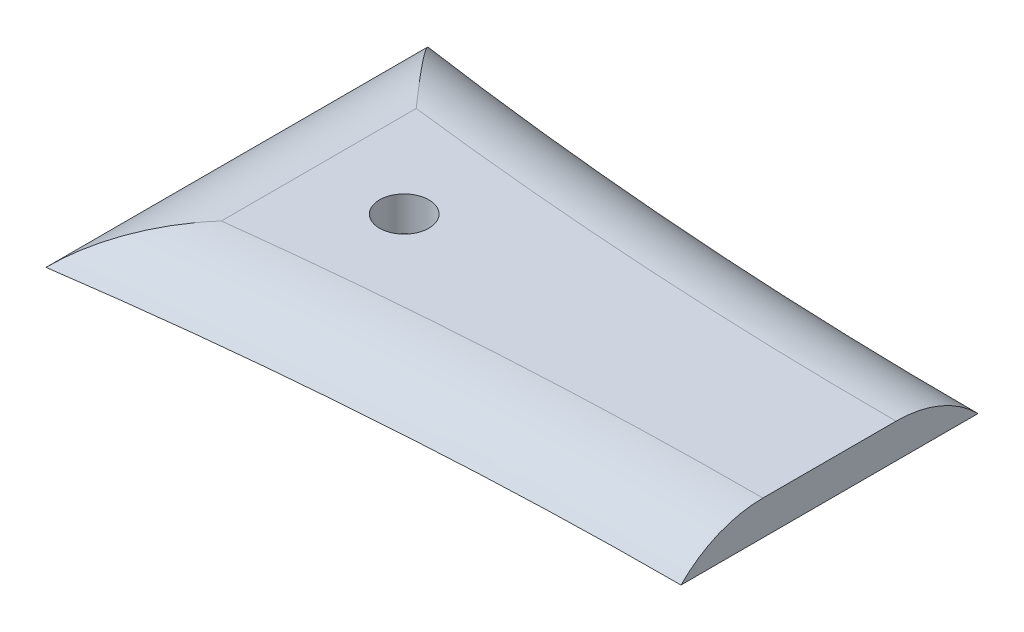
ISO-10303-21;
HEADER;
FILE_DESCRIPTION(('STEP AP214'),'2;1');
FILE_NAME('part.step','',(''),(''),'','','');
FILE_SCHEMA(('AUTOMOTIVE_DESIGN { 1 0 10303 214 1 1 1 1 }'));
ENDSEC;
DATA;
#1=APPLICATION_CONTEXT('core data for automotive mechanical design processes');
#2=APPLICATION_PROTOCOL_DEFINITION('international standard','automotive_design',2000,#1);
#3=PRODUCT_CONTEXT('',#1,'mechanical');
#4=PRODUCT('Part','Part','',(#3));
#5=PRODUCT_RELATED_PRODUCT_CATEGORY('part','',(#4));
#6=PRODUCT_DEFINITION_FORMATION('','',#4);
#7=PRODUCT_DEFINITION_CONTEXT('part definition',#1,'design');
#8=PRODUCT_DEFINITION('design','',#6,#7);
#9=PRODUCT_DEFINITION_SHAPE('','',#8);
#10=(LENGTH_UNIT() NAMED_UNIT(*) SI_UNIT(.MILLI.,.METRE.));
#11=(NAMED_UNIT(*) PLANE_ANGLE_UNIT() SI_UNIT($,.RADIAN.));
#12=(NAMED_UNIT(*) SI_UNIT($,.STERADIAN.) SOLID_ANGLE_UNIT());
#13=UNCERTAINTY_MEASURE_WITH_UNIT(LENGTH_MEASURE(1.E-05),#10,'distance_accuracy_value','');
#14=(GEOMETRIC_REPRESENTATION_CONTEXT(3) GLOBAL_UNCERTAINTY_ASSIGNED_CONTEXT((#13)) GLOBAL_UNIT_ASSIGNED_CONTEXT((#10,
#11,#12)) REPRESENTATION_CONTEXT('',''));
#15=CARTESIAN_POINT('',(0.,0.,0.));
#16=DIRECTION('',(0.,0.,1.));
#17=DIRECTION('',(1.,0.,0.));
#18=AXIS2_PLACEMENT_3D('',#15,#16,#17);
#19=CARTESIAN_POINT('',(69.6952615184339,109.,-379.68937505856));
#20=DIRECTION('',(0.,1.,0.));
#21=DIRECTION('',(0.,0.,1.));
#22=AXIS2_PLACEMENT_3D('',#19,#20,#21);
#23=PLANE('',#22);
#24=CARTESIAN_POINT('',(32.6163634932053,109.,-3.74289004787089));
#25=DIRECTION('',(0.,1.,0.));
#26=DIRECTION('',(0.,0.,1.));
#27=AXIS2_PLACEMENT_3D('',#24,#25,#26);
#28=CIRCLE('',#27,2.15);
#29=CARTESIAN_POINT('',(32.6163634932053,109.,-1.59289004787089));
#30=VERTEX_POINT('',#29);
#31=EDGE_CURVE('E89',#30,#30,#28,.T.);
#32=ORIENTED_EDGE('',*,*,#31,.F.);
#33=EDGE_LOOP('',(#32));
#34=FACE_BOUND('',#33,.T.);
#35=CARTESIAN_POINT('',(69.6952615184333,109.,372.203594962857));
#36=DIRECTION('',(0.,1.,0.));
#37=DIRECTION('',(0.,0.,1.));
#38=AXIS2_PLACEMENT_3D('',#35,#36,#37);
#39=CIRCLE('',#38,370.140811549953);
#40=CARTESIAN_POINT('',(25.1708678379279,109.,4.75047041192654));
#41=VERTEX_POINT('',#40);
#42=CARTESIAN_POINT('',(69.6952615184345,109.,2.06278341290339));
#43=VERTEX_POINT('',#42);
#44=EDGE_CURVE('E51',#41,#43,#39,.F.);
#45=ORIENTED_EDGE('',*,*,#44,.T.);
#46=DIRECTION('',(0.,0.,-1.));
#47=VECTOR('',#46,1.);
#48=CARTESIAN_POINT('',(69.6952615184345,109.,-379.68937505856));
#49=LINE('',#48,#47);
#50=CARTESIAN_POINT('',(69.6952615184339,109.,-9.54856350864486));
#51=VERTEX_POINT('',#50);
#52=EDGE_CURVE('E85',#43,#51,#49,.T.);
#53=ORIENTED_EDGE('',*,*,#52,.T.);
#54=CARTESIAN_POINT('',(69.6952615184339,109.,-379.68937505856));
#55=DIRECTION('',(0.,1.,0.));
#56=DIRECTION('',(0.,0.,1.));
#57=AXIS2_PLACEMENT_3D('',#54,#55,#56);
#58=CIRCLE('',#57,370.140811549916);
#59=CARTESIAN_POINT('',(25.1708678379279,109.,-12.2362505076684));
#60=VERTEX_POINT('',#59);
#61=EDGE_CURVE('E102',#51,#60,#58,.F.);
#62=ORIENTED_EDGE('',*,*,#61,.T.);
#63=DIRECTION('',(0.,0.,-1.));
#64=VECTOR('',#63,1.);
#65=CARTESIAN_POINT('',(25.1708678379279,109.,12.8998307572465));
#66=LINE('',#65,#64);
#67=EDGE_CURVE('E65',#60,#41,#66,.F.);
#68=ORIENTED_EDGE('',*,*,#67,.T.);
#69=EDGE_LOOP('',(#45,#53,#62,#68));
#70=FACE_BOUND('',#69,.T.);
#71=ADVANCED_FACE('F42',(#34,#70),#23,.T.);
#72=CARTESIAN_POINT('',(69.6952615184339,106.,-379.68937505856));
#73=DIRECTION('',(0.,1.,0.));
#74=DIRECTION('',(0.,0.,1.));
#75=AXIS2_PLACEMENT_3D('',#72,#73,#74);
#76=PLANE('',#75);
#77=CARTESIAN_POINT('',(32.6163634932053,106.,-3.74289004787089));
#78=DIRECTION('',(0.,1.,0.));
#79=DIRECTION('',(0.,0.,1.));
#80=AXIS2_PLACEMENT_3D('',#77,#78,#79);
#81=CIRCLE('',#80,2.15);
#82=CARTESIAN_POINT('',(32.6163634932053,106.,-1.59289004787089));
#83=VERTEX_POINT('',#82);
#84=EDGE_CURVE('E119',#83,#83,#81,.T.);
#85=ORIENTED_EDGE('',*,*,#84,.T.);
#86=EDGE_LOOP('',(#85));
#87=FACE_BOUND('',#86,.T.);
#88=DIRECTION('',(0.,0.,1.));
#89=VECTOR('',#88,1.);
#90=CARTESIAN_POINT('',(69.6952615184345,106.,0.));
#91=LINE('',#90,#89);
#92=CARTESIAN_POINT('',(69.6952615184345,106.,-16.6899919371877));
#93=VERTEX_POINT('',#92);
#94=CARTESIAN_POINT('',(69.6952615184345,106.,9.20421184144626));
#95=VERTEX_POINT('',#94);
#96=EDGE_CURVE('E58',#93,#95,#91,.T.);
#97=ORIENTED_EDGE('',*,*,#96,.T.);
#98=CARTESIAN_POINT('',(69.6952615184333,106.,372.203594962857));
#99=DIRECTION('',(0.,-1.,0.));
#100=DIRECTION('',(0.,0.,-1.));
#101=AXIS2_PLACEMENT_3D('',#98,#99,#100);
#102=CIRCLE('',#101,362.99938312141);
#103=CARTESIAN_POINT('',(18.0294394093851,106.,12.8998307572465));
#104=VERTEX_POINT('',#103);
#105=EDGE_CURVE('E95',#104,#95,#102,.T.);
#106=ORIENTED_EDGE('',*,*,#105,.F.);
#107=DIRECTION('',(0.,0.,1.));
#108=VECTOR('',#107,1.);
#109=CARTESIAN_POINT('',(18.0294394093851,106.,-20.3856108529885));
#110=LINE('',#109,#108);
#111=CARTESIAN_POINT('',(18.0294394093851,106.,-20.3856108529885));
#112=VERTEX_POINT('',#111);
#113=EDGE_CURVE('E103',#112,#104,#110,.T.);
#114=ORIENTED_EDGE('',*,*,#113,.F.);
#115=CARTESIAN_POINT('',(69.6952615184339,106.,-379.68937505856));
#116=DIRECTION('',(0.,-1.,0.));
#117=DIRECTION('',(0.,0.,1.));
#118=AXIS2_PLACEMENT_3D('',#115,#116,#117);
#119=CIRCLE('',#118,362.999383121373);
#120=EDGE_CURVE('E97',#93,#112,#119,.T.);
#121=ORIENTED_EDGE('',*,*,#120,.F.);
#122=EDGE_LOOP('',(#97,#106,#114,#121));
#123=FACE_BOUND('',#122,.T.);
#124=ADVANCED_FACE('F93',(#87,#123),#76,.F.);
#125=CARTESIAN_POINT('',(69.6952615184333,99.,372.203594962857));
#126=DIRECTION('',(0.,1.,0.));
#127=DIRECTION('',(0.,0.,1.));
#128=AXIS2_PLACEMENT_3D('',#125,#126,#127);
#129=TOROIDAL_SURFACE('',#128,370.140811549953,10.);
#130=ORIENTED_EDGE('',*,*,#105,.T.);
#131=CARTESIAN_POINT('',(69.6952615184333,99.,2.06278341290339));
#132=DIRECTION('',(1.,0.,0.));
#133=DIRECTION('',(0.,0.,-1.));
#134=AXIS2_PLACEMENT_3D('',#131,#132,#133);
#135=CIRCLE('',#134,10.);
#136=EDGE_CURVE('E82',#95,#43,#135,.F.);
#137=ORIENTED_EDGE('',*,*,#136,.T.);
#138=ORIENTED_EDGE('',*,*,#44,.F.);
#139=CARTESIAN_POINT('',(18.0294394093851,106.,12.8998307572465));
#140=CARTESIAN_POINT('',(18.1449813108946,106.117865969299,12.7664859797561));
#141=CARTESIAN_POINT('',(18.2622845363039,106.231712752767,12.631183162665));
#142=CARTESIAN_POINT('',(18.5000364090133,106.451593944441,12.3571080785624));
#143=CARTESIAN_POINT('',(18.6204843309905,106.557630132969,12.2183366119028));
#144=CARTESIAN_POINT('',(18.9857130839517,106.864148379039,11.7977955447066));
#145=CARTESIAN_POINT('',(19.2347098856554,107.053374246604,11.5114172311703));
#146=CARTESIAN_POINT('',(19.7410479827984,107.403069740267,10.9297811905293));
#147=CARTESIAN_POINT('',(19.9983755573208,107.563584066711,10.6345381167586));
#148=CARTESIAN_POINT('',(20.5200455747988,107.857738827676,10.0367552250998));
#149=CARTESIAN_POINT('',(20.7843909994028,107.991367625707,9.73421231089665));
#150=CARTESIAN_POINT('',(21.3828037631034,108.261902553993,9.05020399669834));
#151=CARTESIAN_POINT('',(21.7183392039255,108.391856916062,8.66726874106068));
#152=CARTESIAN_POINT('',(22.3954522670775,108.613739916917,7.89574285970273));
#153=CARTESIAN_POINT('',(22.7370308722088,108.70566231016,7.50715131595462));
#154=CARTESIAN_POINT('',(23.4239743836281,108.852494382297,6.72692131599745));
#155=CARTESIAN_POINT('',(23.7693363067705,108.907431350717,6.33528532243078));
#156=CARTESIAN_POINT('',(24.4622492564055,108.980938783045,5.55079797841888));
#157=CARTESIAN_POINT('',(24.8097990360909,108.999528357485,5.15794737547093));
#158=CARTESIAN_POINT('',(25.1619927522922,108.999997044012,4.76048591187061));
#159=CARTESIAN_POINT('',(25.1664302793188,108.99999999774,4.75547812842836));
#160=CARTESIAN_POINT('',(25.1708678379279,109.,4.75047041192648));
#161=B_SPLINE_CURVE_WITH_KNOTS('',3,(#139,#140,#141,#142,#143,#144,#145,#146,#147,#148,#149,
#150,#151,#152,#153,#154,#155,#156,#157,#158,#159,#160),.UNSPECIFIED.,.F.,.F.,(4,2,2,2,2,2,2,2,
2,2,4),(0.,0.636432251610286,1.27271898506955,2.54348036548556,3.81224577198662,
5.08155914480961,6.65636793901592,8.23143524295143,9.80533911321836,11.3784152422929,
11.3984882546566),.UNSPECIFIED.);
#162=EDGE_CURVE('E101',#41,#104,#161,.F.);
#163=ORIENTED_EDGE('',*,*,#162,.T.);
#164=EDGE_LOOP('',(#130,#137,#138,#163));
#165=FACE_BOUND('',#164,.T.);
#166=ADVANCED_FACE('F100',(#165),#129,.T.);
#167=CARTESIAN_POINT('',(69.6952615184339,99.,-379.68937505856));
#168=DIRECTION('',(0.,1.,0.));
#169=DIRECTION('',(0.,0.,1.));
#170=AXIS2_PLACEMENT_3D('',#167,#168,#169);
#171=TOROIDAL_SURFACE('',#170,370.140811549916,10.);
#172=ORIENTED_EDGE('',*,*,#61,.F.);
#173=CARTESIAN_POINT('',(69.6952615184339,99.,-9.54856350864486));
#174=DIRECTION('',(1.,0.,0.));
#175=DIRECTION('',(0.,0.,-1.));
#176=AXIS2_PLACEMENT_3D('',#173,#174,#175);
#177=CIRCLE('',#176,10.);
#178=EDGE_CURVE('E11',#51,#93,#177,.F.);
#179=ORIENTED_EDGE('',*,*,#178,.T.);
#180=ORIENTED_EDGE('',*,*,#120,.T.);
#181=CARTESIAN_POINT('',(18.0294394093851,106.,-20.3856108529885));
#182=CARTESIAN_POINT('',(18.1449813108946,106.117865969299,-20.252266075498));
#183=CARTESIAN_POINT('',(18.2622845363039,106.231712752767,-20.1169632584069));
#184=CARTESIAN_POINT('',(18.5000364090133,106.451593944441,-19.8428881743044));
#185=CARTESIAN_POINT('',(18.6204843309905,106.557630132969,-19.7041167076447));
#186=CARTESIAN_POINT('',(18.9857130839517,106.864148379039,-19.2835756404487));
#187=CARTESIAN_POINT('',(19.2347098856553,107.053374246604,-18.9971973269122));
#188=CARTESIAN_POINT('',(19.7410479827984,107.403069740267,-18.4155612862712));
#189=CARTESIAN_POINT('',(19.9983755573207,107.563584066711,-18.1203182125005));
#190=CARTESIAN_POINT('',(20.5200455747987,107.857738827676,-17.5225353208417));
#191=CARTESIAN_POINT('',(20.7843909994027,107.991367625707,-17.2199924066385));
#192=CARTESIAN_POINT('',(21.3828037631034,108.261902553993,-16.5359840924402));
#193=CARTESIAN_POINT('',(21.7183392039255,108.391856916062,-16.1530488368026));
#194=CARTESIAN_POINT('',(22.3954522670774,108.613739916917,-15.3815229554446));
#195=CARTESIAN_POINT('',(22.7370308722085,108.70566231016,-14.9929314116963));
#196=CARTESIAN_POINT('',(23.4239743836283,108.852494382297,-14.2127014117395));
#197=CARTESIAN_POINT('',(23.7693363067712,108.907431350717,-13.8210654181733));
#198=CARTESIAN_POINT('',(24.4622492564048,108.980938783045,-13.0365780741601));
#199=CARTESIAN_POINT('',(24.8097990360883,108.999528357485,-12.6437274712105));
#200=CARTESIAN_POINT('',(25.1619927522922,108.999997044012,-12.2462660076124));
#201=CARTESIAN_POINT('',(25.1664302793188,108.99999999774,-12.2412582241702));
#202=CARTESIAN_POINT('',(25.1708678379279,109.,-12.2362505076684));
#203=B_SPLINE_CURVE_WITH_KNOTS('',3,(#181,#182,#183,#184,#185,#186,#187,#188,#189,#190,#191,
#192,#193,#194,#195,#196,#197,#198,#199,#200,#201,#202),.UNSPECIFIED.,.F.,.F.,(4,2,2,2,2,2,2,2,
2,2,4),(0.,0.636432251610283,1.27271898506953,2.54348036548552,3.8122457719866,5.08155914480961,
6.65636793901594,8.23143524295148,9.80533911321841,11.378415242293,11.3984882546567),.UNSPECIFIED.);
#204=EDGE_CURVE('E111',#112,#60,#203,.T.);
#205=ORIENTED_EDGE('',*,*,#204,.T.);
#206=EDGE_LOOP('',(#172,#179,#180,#205));
#207=FACE_BOUND('',#206,.T.);
#208=ADVANCED_FACE('F124',(#207),#171,.T.);
#209=CARTESIAN_POINT('',(25.1708678379279,99.,-20.3856108529885));
#210=DIRECTION('',(0.,0.,1.));
#211=DIRECTION('',(1.,0.,0.));
#212=AXIS2_PLACEMENT_3D('',#209,#210,#211);
#213=CYLINDRICAL_SURFACE('',#212,10.);
#214=ORIENTED_EDGE('',*,*,#204,.F.);
#215=ORIENTED_EDGE('',*,*,#113,.T.);
#216=ORIENTED_EDGE('',*,*,#162,.F.);
#217=ORIENTED_EDGE('',*,*,#67,.F.);
#218=EDGE_LOOP('',(#214,#215,#216,#217));
#219=FACE_BOUND('',#218,.T.);
#220=ADVANCED_FACE('F44',(#219),#213,.T.);
#221=CARTESIAN_POINT('',(32.6163634932053,4.,-3.74289004787089));
#222=DIRECTION('',(0.,1.,0.));
#223=DIRECTION('',(0.,0.,1.));
#224=AXIS2_PLACEMENT_3D('',#221,#222,#223);
#225=CYLINDRICAL_SURFACE('',#224,2.15);
#226=ORIENTED_EDGE('',*,*,#31,.T.);
#227=EDGE_LOOP('',(#226));
#228=FACE_BOUND('',#227,.T.);
#229=ORIENTED_EDGE('',*,*,#84,.F.);
#230=EDGE_LOOP('',(#229));
#231=FACE_BOUND('',#230,.T.);
#232=ADVANCED_FACE('F142',(#228,#231),#225,.F.);
#233=CARTESIAN_POINT('',(69.6952615184345,132.,0.));
#234=DIRECTION('',(1.,0.,0.));
#235=DIRECTION('',(0.,0.,-1.));
#236=AXIS2_PLACEMENT_3D('',#233,#234,#235);
#237=PLANE('',#236);
#238=ORIENTED_EDGE('',*,*,#96,.F.);
#239=ORIENTED_EDGE('',*,*,#178,.F.);
#240=ORIENTED_EDGE('',*,*,#52,.F.);
#241=ORIENTED_EDGE('',*,*,#136,.F.);
#242=EDGE_LOOP('',(#238,#239,#240,#241));
#243=FACE_BOUND('',#242,.T.);
#244=ADVANCED_FACE('F83',(#243),#237,.T.);
#245=CLOSED_SHELL('',(#71,#124,#166,#208,#220,#232,#244));
#246=MANIFOLD_SOLID_BREP('B2',#245);
#247=ADVANCED_BREP_SHAPE_REPRESENTATION('',(#18,#246),#14);
#248=SHAPE_DEFINITION_REPRESENTATION(#9,#247);
ENDSEC;
END-ISO-10303-21;
